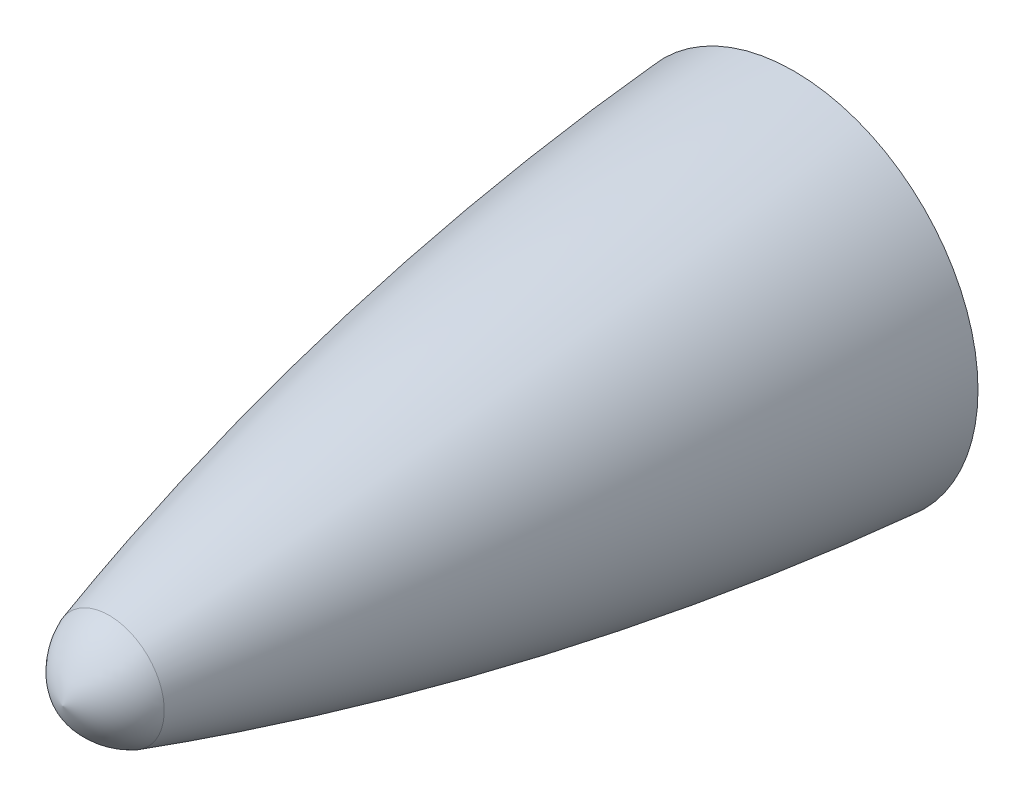
ISO-10303-21;
HEADER;
FILE_DESCRIPTION(('STEP AP214'),'2;1');
FILE_NAME('part.step','',(''),(''),'','','');
FILE_SCHEMA(('AUTOMOTIVE_DESIGN { 1 0 10303 214 1 1 1 1 }'));
ENDSEC;
DATA;
#1=APPLICATION_CONTEXT('core data for automotive mechanical design processes');
#2=APPLICATION_PROTOCOL_DEFINITION('international standard','automotive_design',2000,#1);
#3=PRODUCT_CONTEXT('',#1,'mechanical');
#4=PRODUCT('Part','Part','',(#3));
#5=PRODUCT_RELATED_PRODUCT_CATEGORY('part','',(#4));
#6=PRODUCT_DEFINITION_FORMATION('','',#4);
#7=PRODUCT_DEFINITION_CONTEXT('part definition',#1,'design');
#8=PRODUCT_DEFINITION('design','',#6,#7);
#9=PRODUCT_DEFINITION_SHAPE('','',#8);
#10=(LENGTH_UNIT() NAMED_UNIT(*) SI_UNIT(.MILLI.,.METRE.));
#11=(NAMED_UNIT(*) PLANE_ANGLE_UNIT() SI_UNIT($,.RADIAN.));
#12=(NAMED_UNIT(*) SI_UNIT($,.STERADIAN.) SOLID_ANGLE_UNIT());
#13=UNCERTAINTY_MEASURE_WITH_UNIT(LENGTH_MEASURE(1.E-05),#10,'distance_accuracy_value','');
#14=(GEOMETRIC_REPRESENTATION_CONTEXT(3) GLOBAL_UNCERTAINTY_ASSIGNED_CONTEXT((#13)) GLOBAL_UNIT_ASSIGNED_CONTEXT((#10,
#11,#12)) REPRESENTATION_CONTEXT('',''));
#15=CARTESIAN_POINT('',(0.,0.,0.));
#16=DIRECTION('',(0.,0.,1.));
#17=DIRECTION('',(1.,0.,0.));
#18=AXIS2_PLACEMENT_3D('',#15,#16,#17);
#19=CARTESIAN_POINT('',(0.,0.,12.));
#20=DIRECTION('',(0.,0.,-1.));
#21=DIRECTION('',(-1.,0.,0.));
#22=AXIS2_PLACEMENT_3D('',#19,#20,#21);
#23=PLANE('',#22);
#24=CARTESIAN_POINT('',(0.,0.,12.));
#25=DIRECTION('',(0.,0.,-1.));
#26=DIRECTION('',(-1.,0.,0.));
#27=AXIS2_PLACEMENT_3D('',#24,#25,#26);
#28=CIRCLE('',#27,6.00000000000001);
#29=CARTESIAN_POINT('',(-6.00000000000001,0.,12.));
#30=VERTEX_POINT('',#29);
#31=EDGE_CURVE('E11',#30,#30,#28,.T.);
#32=ORIENTED_EDGE('',*,*,#31,.T.);
#33=EDGE_LOOP('',(#32));
#34=FACE_BOUND('',#33,.T.);
#35=ADVANCED_FACE('F34',(#34),#23,.T.);
#36=CARTESIAN_POINT('',(0.,0.,4.03876712188866));
#37=DIRECTION('',(0.,0.,-1.));
#38=DIRECTION('',(-1.,0.,0.));
#39=AXIS2_PLACEMENT_3D('',#36,#37,#38);
#40=DEGENERATE_TOROIDAL_SURFACE('',#39,97.6663663187666,103.971615043127,.F.);
#41=CARTESIAN_POINT('',(0.,0.,34.3224236218724));
#42=DIRECTION('',(0.,0.,-1.));
#43=DIRECTION('',(-1.,0.,0.));
#44=AXIS2_PLACEMENT_3D('',#41,#42,#43);
#45=CIRCLE('',#44,1.79717918242305);
#46=CARTESIAN_POINT('',(-1.79717918242305,0.,34.3224236218724));
#47=VERTEX_POINT('',#46);
#48=EDGE_CURVE('E41',#47,#47,#45,.T.);
#49=ORIENTED_EDGE('',*,*,#48,.T.);
#50=EDGE_LOOP('',(#49));
#51=FACE_BOUND('',#50,.T.);
#52=ORIENTED_EDGE('',*,*,#31,.F.);
#53=EDGE_LOOP('',(#52));
#54=FACE_BOUND('',#53,.T.);
#55=ADVANCED_FACE('F47',(#51,#54),#40,.F.);
#56=CARTESIAN_POINT('',(0.617190065728447,0.,33.2880767283723));
#57=DIRECTION('',(0.,-1.,0.));
#58=DIRECTION('',(-1.,0.,0.));
#59=AXIS2_PLACEMENT_3D('',#56,#57,#58);
#60=CIRCLE('',#59,2.62660472140609);
#61=TRIMMED_CURVE('',#60,(PARAMETER_VALUE(-1.33360206048748)),
(PARAMETER_VALUE(1.33360206048748)),.T.,.PARAMETER.);
#62=CARTESIAN_POINT('',(0.,0.,33.2880767283723));
#63=DIRECTION('',(0.,0.,-1.));
#64=AXIS1_PLACEMENT('',#62,#63);
#65=SURFACE_OF_REVOLUTION('',#61,#64);
#66=CARTESIAN_POINT('',(0.,0.,35.8411393569185));
#67=VERTEX_POINT('',#66);
#68=VERTEX_LOOP('',#67);
#69=FACE_BOUND('',#68,.T.);
#70=ORIENTED_EDGE('',*,*,#48,.F.);
#71=EDGE_LOOP('',(#70));
#72=FACE_BOUND('',#71,.T.);
#73=ADVANCED_FACE('F44',(#69,#72),#65,.T.);
#74=CLOSED_SHELL('',(#35,#55,#73));
#75=MANIFOLD_SOLID_BREP('B2',#74);
#76=ADVANCED_BREP_SHAPE_REPRESENTATION('',(#18,#75),#14);
#77=SHAPE_DEFINITION_REPRESENTATION(#9,#76);
ENDSEC;
END-ISO-10303-21;
